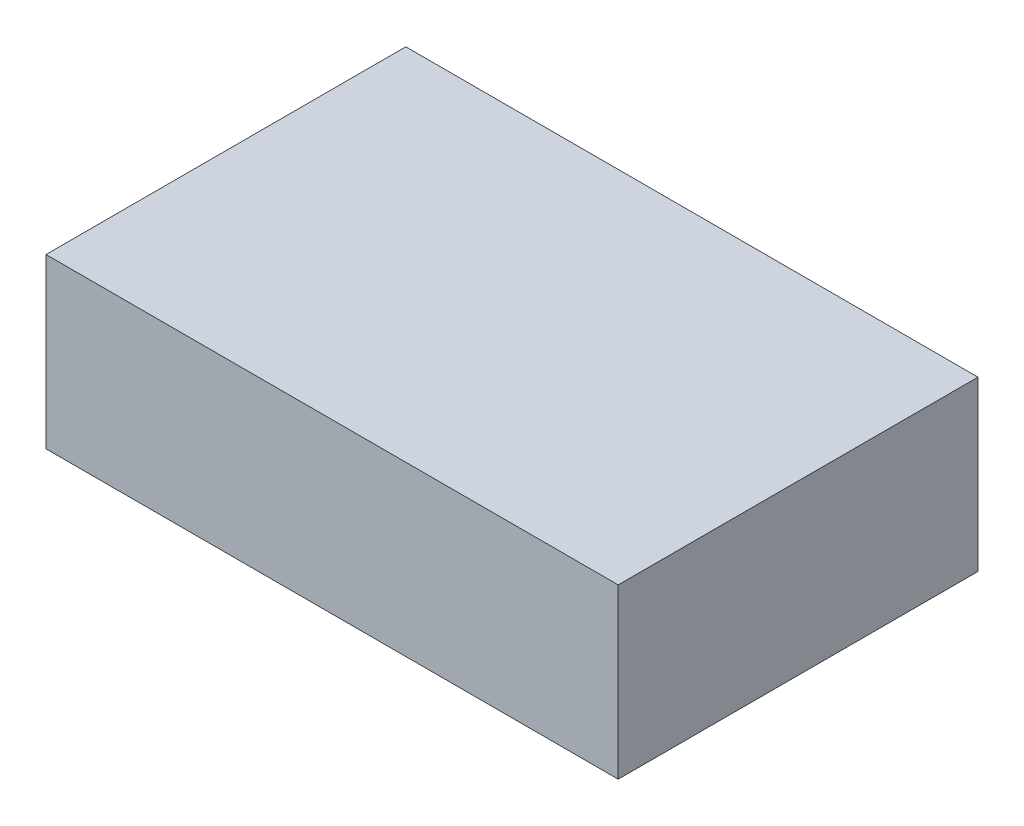
ISO-10303-21;
HEADER;
FILE_DESCRIPTION(('STEP AP214'),'2;1');
FILE_NAME('part.step','',(''),(''),'','','');
FILE_SCHEMA(('AUTOMOTIVE_DESIGN { 1 0 10303 214 1 1 1 1 }'));
ENDSEC;
DATA;
#1=APPLICATION_CONTEXT('core data for automotive mechanical design processes');
#2=APPLICATION_PROTOCOL_DEFINITION('international standard','automotive_design',2000,#1);
#3=PRODUCT_CONTEXT('',#1,'mechanical');
#4=PRODUCT('Part','Part','',(#3));
#5=PRODUCT_RELATED_PRODUCT_CATEGORY('part','',(#4));
#6=PRODUCT_DEFINITION_FORMATION('','',#4);
#7=PRODUCT_DEFINITION_CONTEXT('part definition',#1,'design');
#8=PRODUCT_DEFINITION('design','',#6,#7);
#9=PRODUCT_DEFINITION_SHAPE('','',#8);
#10=(LENGTH_UNIT() NAMED_UNIT(*) SI_UNIT(.MILLI.,.METRE.));
#11=(NAMED_UNIT(*) PLANE_ANGLE_UNIT() SI_UNIT($,.RADIAN.));
#12=(NAMED_UNIT(*) SI_UNIT($,.STERADIAN.) SOLID_ANGLE_UNIT());
#13=UNCERTAINTY_MEASURE_WITH_UNIT(LENGTH_MEASURE(1.E-05),#10,'distance_accuracy_value','');
#14=(GEOMETRIC_REPRESENTATION_CONTEXT(3) GLOBAL_UNCERTAINTY_ASSIGNED_CONTEXT((#13)) GLOBAL_UNIT_ASSIGNED_CONTEXT((#10,
#11,#12)) REPRESENTATION_CONTEXT('',''));
#15=CARTESIAN_POINT('',(0.,0.,0.));
#16=DIRECTION('',(0.,0.,1.));
#17=DIRECTION('',(1.,0.,0.));
#18=AXIS2_PLACEMENT_3D('',#15,#16,#17);
#19=CARTESIAN_POINT('',(0.,29.,0.));
#20=DIRECTION('',(1.,0.,0.));
#21=DIRECTION('',(0.,0.,-1.));
#22=AXIS2_PLACEMENT_3D('',#19,#20,#21);
#23=PLANE('',#22);
#24=DIRECTION('',(0.,0.,1.));
#25=VECTOR('',#24,1.);
#26=CARTESIAN_POINT('',(0.,0.,0.));
#27=LINE('',#26,#25);
#28=CARTESIAN_POINT('',(0.,0.,0.));
#29=VERTEX_POINT('',#28);
#30=CARTESIAN_POINT('',(0.,0.,62.));
#31=VERTEX_POINT('',#30);
#32=EDGE_CURVE('E97',#29,#31,#27,.T.);
#33=ORIENTED_EDGE('',*,*,#32,.T.);
#34=DIRECTION('',(0.,-1.,0.));
#35=VECTOR('',#34,1.);
#36=CARTESIAN_POINT('',(0.,29.,62.));
#37=LINE('',#36,#35);
#38=CARTESIAN_POINT('',(0.,29.,62.));
#39=VERTEX_POINT('',#38);
#40=EDGE_CURVE('E11',#39,#31,#37,.T.);
#41=ORIENTED_EDGE('',*,*,#40,.F.);
#42=DIRECTION('',(0.,0.,1.));
#43=VECTOR('',#42,1.);
#44=CARTESIAN_POINT('',(0.,29.,0.));
#45=LINE('',#44,#43);
#46=CARTESIAN_POINT('',(0.,29.,0.));
#47=VERTEX_POINT('',#46);
#48=EDGE_CURVE('E85',#47,#39,#45,.T.);
#49=ORIENTED_EDGE('',*,*,#48,.F.);
#50=DIRECTION('',(0.,-1.,0.));
#51=VECTOR('',#50,1.);
#52=CARTESIAN_POINT('',(0.,29.,0.));
#53=LINE('',#52,#51);
#54=EDGE_CURVE('E93',#47,#29,#53,.T.);
#55=ORIENTED_EDGE('',*,*,#54,.T.);
#56=EDGE_LOOP('',(#33,#41,#49,#55));
#57=FACE_BOUND('',#56,.T.);
#58=ADVANCED_FACE('F34',(#57),#23,.F.);
#59=CARTESIAN_POINT('',(0.,29.,62.));
#60=DIRECTION('',(0.,0.,-1.));
#61=DIRECTION('',(-1.,0.,0.));
#62=AXIS2_PLACEMENT_3D('',#59,#60,#61);
#63=PLANE('',#62);
#64=DIRECTION('',(1.,0.,0.));
#65=VECTOR('',#64,1.);
#66=CARTESIAN_POINT('',(0.,0.,62.));
#67=LINE('',#66,#65);
#68=CARTESIAN_POINT('',(98.6,0.,62.));
#69=VERTEX_POINT('',#68);
#70=EDGE_CURVE('E89',#31,#69,#67,.T.);
#71=ORIENTED_EDGE('',*,*,#70,.T.);
#72=DIRECTION('',(0.,-1.,0.));
#73=VECTOR('',#72,1.);
#74=CARTESIAN_POINT('',(98.6,29.,62.));
#75=LINE('',#74,#73);
#76=CARTESIAN_POINT('',(98.6,29.,62.));
#77=VERTEX_POINT('',#76);
#78=EDGE_CURVE('E42',#77,#69,#75,.T.);
#79=ORIENTED_EDGE('',*,*,#78,.F.);
#80=DIRECTION('',(1.,0.,0.));
#81=VECTOR('',#80,1.);
#82=CARTESIAN_POINT('',(0.,29.,62.));
#83=LINE('',#82,#81);
#84=EDGE_CURVE('E80',#39,#77,#83,.T.);
#85=ORIENTED_EDGE('',*,*,#84,.F.);
#86=ORIENTED_EDGE('',*,*,#40,.T.);
#87=EDGE_LOOP('',(#71,#79,#85,#86));
#88=FACE_BOUND('',#87,.T.);
#89=ADVANCED_FACE('F88',(#88),#63,.F.);
#90=CARTESIAN_POINT('',(98.6,29.,0.));
#91=DIRECTION('',(-1.,0.,0.));
#92=DIRECTION('',(0.,0.,1.));
#93=AXIS2_PLACEMENT_3D('',#90,#91,#92);
#94=PLANE('',#93);
#95=DIRECTION('',(0.,0.,-1.));
#96=VECTOR('',#95,1.);
#97=CARTESIAN_POINT('',(98.6,0.,0.));
#98=LINE('',#97,#96);
#99=CARTESIAN_POINT('',(98.6,0.,0.));
#100=VERTEX_POINT('',#99);
#101=EDGE_CURVE('E67',#69,#100,#98,.T.);
#102=ORIENTED_EDGE('',*,*,#101,.T.);
#103=DIRECTION('',(0.,-1.,0.));
#104=VECTOR('',#103,1.);
#105=CARTESIAN_POINT('',(98.6,29.,0.));
#106=LINE('',#105,#104);
#107=CARTESIAN_POINT('',(98.6,29.,0.));
#108=VERTEX_POINT('',#107);
#109=EDGE_CURVE('E90',#108,#100,#106,.T.);
#110=ORIENTED_EDGE('',*,*,#109,.F.);
#111=DIRECTION('',(0.,0.,-1.));
#112=VECTOR('',#111,1.);
#113=CARTESIAN_POINT('',(98.6,29.,0.));
#114=LINE('',#113,#112);
#115=EDGE_CURVE('E83',#77,#108,#114,.T.);
#116=ORIENTED_EDGE('',*,*,#115,.F.);
#117=ORIENTED_EDGE('',*,*,#78,.T.);
#118=EDGE_LOOP('',(#102,#110,#116,#117));
#119=FACE_BOUND('',#118,.T.);
#120=ADVANCED_FACE('F91',(#119),#94,.F.);
#121=CARTESIAN_POINT('',(0.,29.,0.));
#122=DIRECTION('',(0.,0.,1.));
#123=DIRECTION('',(1.,0.,0.));
#124=AXIS2_PLACEMENT_3D('',#121,#122,#123);
#125=PLANE('',#124);
#126=DIRECTION('',(-1.,0.,0.));
#127=VECTOR('',#126,1.);
#128=CARTESIAN_POINT('',(0.,0.,0.));
#129=LINE('',#128,#127);
#130=EDGE_CURVE('E73',#100,#29,#129,.T.);
#131=ORIENTED_EDGE('',*,*,#130,.T.);
#132=ORIENTED_EDGE('',*,*,#54,.F.);
#133=DIRECTION('',(-1.,0.,0.));
#134=VECTOR('',#133,1.);
#135=CARTESIAN_POINT('',(0.,29.,0.));
#136=LINE('',#135,#134);
#137=EDGE_CURVE('E50',#108,#47,#136,.T.);
#138=ORIENTED_EDGE('',*,*,#137,.F.);
#139=ORIENTED_EDGE('',*,*,#109,.T.);
#140=EDGE_LOOP('',(#131,#132,#138,#139));
#141=FACE_BOUND('',#140,.T.);
#142=ADVANCED_FACE('F104',(#141),#125,.F.);
#143=CARTESIAN_POINT('',(0.,29.,0.));
#144=DIRECTION('',(0.,1.,0.));
#145=DIRECTION('',(0.,0.,1.));
#146=AXIS2_PLACEMENT_3D('',#143,#144,#145);
#147=PLANE('',#146);
#148=ORIENTED_EDGE('',*,*,#48,.T.);
#149=ORIENTED_EDGE('',*,*,#84,.T.);
#150=ORIENTED_EDGE('',*,*,#115,.T.);
#151=ORIENTED_EDGE('',*,*,#137,.T.);
#152=EDGE_LOOP('',(#148,#149,#150,#151));
#153=FACE_BOUND('',#152,.T.);
#154=ADVANCED_FACE('F81',(#153),#147,.T.);
#155=CARTESIAN_POINT('',(0.,0.,0.));
#156=DIRECTION('',(0.,1.,0.));
#157=DIRECTION('',(0.,0.,1.));
#158=AXIS2_PLACEMENT_3D('',#155,#156,#157);
#159=PLANE('',#158);
#160=ORIENTED_EDGE('',*,*,#32,.F.);
#161=ORIENTED_EDGE('',*,*,#130,.F.);
#162=ORIENTED_EDGE('',*,*,#101,.F.);
#163=ORIENTED_EDGE('',*,*,#70,.F.);
#164=EDGE_LOOP('',(#160,#161,#162,#163));
#165=FACE_BOUND('',#164,.T.);
#166=ADVANCED_FACE('F107',(#165),#159,.F.);
#167=CLOSED_SHELL('',(#58,#89,#120,#142,#154,#166));
#168=MANIFOLD_SOLID_BREP('B2',#167);
#169=ADVANCED_BREP_SHAPE_REPRESENTATION('',(#18,#168),#14);
#170=SHAPE_DEFINITION_REPRESENTATION(#9,#169);
ENDSEC;
END-ISO-10303-21;
